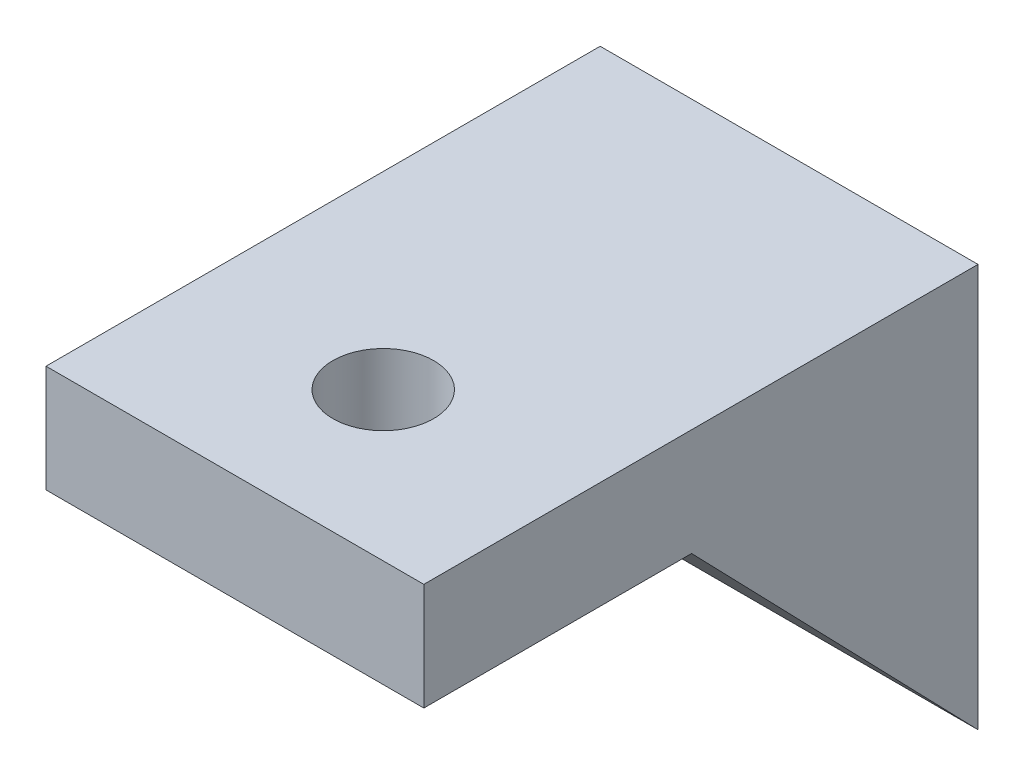
ISO-10303-21;
HEADER;
FILE_DESCRIPTION(('STEP AP214'),'2;1');
FILE_NAME('part.step','',(''),(''),'','','');
FILE_SCHEMA(('AUTOMOTIVE_DESIGN { 1 0 10303 214 1 1 1 1 }'));
ENDSEC;
DATA;
#1=APPLICATION_CONTEXT('core data for automotive mechanical design processes');
#2=APPLICATION_PROTOCOL_DEFINITION('international standard','automotive_design',2000,#1);
#3=PRODUCT_CONTEXT('',#1,'mechanical');
#4=PRODUCT('Part','Part','',(#3));
#5=PRODUCT_RELATED_PRODUCT_CATEGORY('part','',(#4));
#6=PRODUCT_DEFINITION_FORMATION('','',#4);
#7=PRODUCT_DEFINITION_CONTEXT('part definition',#1,'design');
#8=PRODUCT_DEFINITION('design','',#6,#7);
#9=PRODUCT_DEFINITION_SHAPE('','',#8);
#10=(LENGTH_UNIT() NAMED_UNIT(*) SI_UNIT(.MILLI.,.METRE.));
#11=(NAMED_UNIT(*) PLANE_ANGLE_UNIT() SI_UNIT($,.RADIAN.));
#12=(NAMED_UNIT(*) SI_UNIT($,.STERADIAN.) SOLID_ANGLE_UNIT());
#13=UNCERTAINTY_MEASURE_WITH_UNIT(LENGTH_MEASURE(1.E-05),#10,'distance_accuracy_value','');
#14=(GEOMETRIC_REPRESENTATION_CONTEXT(3) GLOBAL_UNCERTAINTY_ASSIGNED_CONTEXT((#13)) GLOBAL_UNIT_ASSIGNED_CONTEXT((#10,
#11,#12)) REPRESENTATION_CONTEXT('',''));
#15=CARTESIAN_POINT('',(0.,0.,0.));
#16=DIRECTION('',(0.,0.,1.));
#17=DIRECTION('',(1.,0.,0.));
#18=AXIS2_PLACEMENT_3D('',#15,#16,#17);
#19=CARTESIAN_POINT('',(-7.5,-8.,22.));
#20=DIRECTION('',(1.,0.,0.));
#21=DIRECTION('',(0.,0.,-1.));
#22=AXIS2_PLACEMENT_3D('',#19,#20,#21);
#23=PLANE('',#22);
#24=DIRECTION('',(0.,-0.718507049595563,-0.695519675984425));
#25=VECTOR('',#24,1.);
#26=CARTESIAN_POINT('',(-7.5,2.99418738719908,10.6424476329926));
#27=LINE('',#26,#25);
#28=CARTESIAN_POINT('',(-7.5,3.74573308859119,11.3699489470213));
#29=VERTEX_POINT('',#28);
#30=CARTESIAN_POINT('',(-7.5,-8.,0.));
#31=VERTEX_POINT('',#30);
#32=EDGE_CURVE('E129',#29,#31,#27,.T.);
#33=ORIENTED_EDGE('',*,*,#32,.F.);
#34=DIRECTION('',(0.,0.,-1.));
#35=VECTOR('',#34,1.);
#36=CARTESIAN_POINT('',(-7.5,3.74573308859119,22.));
#37=LINE('',#36,#35);
#38=CARTESIAN_POINT('',(-7.5,3.74573308859119,22.));
#39=VERTEX_POINT('',#38);
#40=EDGE_CURVE('E100',#39,#29,#37,.T.);
#41=ORIENTED_EDGE('',*,*,#40,.F.);
#42=DIRECTION('',(0.,-1.,0.));
#43=VECTOR('',#42,1.);
#44=CARTESIAN_POINT('',(-7.5,-8.,22.));
#45=LINE('',#44,#43);
#46=CARTESIAN_POINT('',(-7.5,8.,22.));
#47=VERTEX_POINT('',#46);
#48=EDGE_CURVE('E88',#47,#39,#45,.T.);
#49=ORIENTED_EDGE('',*,*,#48,.F.);
#50=DIRECTION('',(0.,0.,-1.));
#51=VECTOR('',#50,1.);
#52=CARTESIAN_POINT('',(-7.5,8.,22.));
#53=LINE('',#52,#51);
#54=CARTESIAN_POINT('',(-7.5,8.,0.));
#55=VERTEX_POINT('',#54);
#56=EDGE_CURVE('E84',#47,#55,#53,.T.);
#57=ORIENTED_EDGE('',*,*,#56,.T.);
#58=DIRECTION('',(0.,-1.,0.));
#59=VECTOR('',#58,1.);
#60=CARTESIAN_POINT('',(-7.5,-8.,0.));
#61=LINE('',#60,#59);
#62=EDGE_CURVE('E93',#55,#31,#61,.T.);
#63=ORIENTED_EDGE('',*,*,#62,.T.);
#64=EDGE_LOOP('',(#33,#41,#49,#57,#63));
#65=FACE_BOUND('',#64,.T.);
#66=ADVANCED_FACE('F44',(#65),#23,.F.);
#67=CARTESIAN_POINT('',(7.5,-8.,22.));
#68=DIRECTION('',(-1.,0.,0.));
#69=DIRECTION('',(0.,0.,1.));
#70=AXIS2_PLACEMENT_3D('',#67,#68,#69);
#71=PLANE('',#70);
#72=DIRECTION('',(0.,0.718507049595563,0.695519675984425));
#73=VECTOR('',#72,1.);
#74=CARTESIAN_POINT('',(7.5,2.99418738719908,10.6424476329926));
#75=LINE('',#74,#73);
#76=CARTESIAN_POINT('',(7.5,-8.,0.));
#77=VERTEX_POINT('',#76);
#78=CARTESIAN_POINT('',(7.5,3.74573308859119,11.3699489470213));
#79=VERTEX_POINT('',#78);
#80=EDGE_CURVE('E117',#77,#79,#75,.T.);
#81=ORIENTED_EDGE('',*,*,#80,.F.);
#82=DIRECTION('',(0.,1.,0.));
#83=VECTOR('',#82,1.);
#84=CARTESIAN_POINT('',(7.5,-8.,0.));
#85=LINE('',#84,#83);
#86=CARTESIAN_POINT('',(7.5,8.,0.));
#87=VERTEX_POINT('',#86);
#88=EDGE_CURVE('E76',#77,#87,#85,.T.);
#89=ORIENTED_EDGE('',*,*,#88,.T.);
#90=DIRECTION('',(0.,0.,-1.));
#91=VECTOR('',#90,1.);
#92=CARTESIAN_POINT('',(7.5,8.,22.));
#93=LINE('',#92,#91);
#94=CARTESIAN_POINT('',(7.5,8.,22.));
#95=VERTEX_POINT('',#94);
#96=EDGE_CURVE('E53',#95,#87,#93,.T.);
#97=ORIENTED_EDGE('',*,*,#96,.F.);
#98=DIRECTION('',(0.,1.,0.));
#99=VECTOR('',#98,1.);
#100=CARTESIAN_POINT('',(7.5,-8.,22.));
#101=LINE('',#100,#99);
#102=CARTESIAN_POINT('',(7.5,3.74573308859119,22.));
#103=VERTEX_POINT('',#102);
#104=EDGE_CURVE('E133',#103,#95,#101,.T.);
#105=ORIENTED_EDGE('',*,*,#104,.F.);
#106=DIRECTION('',(0.,0.,1.));
#107=VECTOR('',#106,1.);
#108=CARTESIAN_POINT('',(7.5,3.74573308859119,22.));
#109=LINE('',#108,#107);
#110=EDGE_CURVE('E104',#79,#103,#109,.T.);
#111=ORIENTED_EDGE('',*,*,#110,.F.);
#112=EDGE_LOOP('',(#81,#89,#97,#105,#111));
#113=FACE_BOUND('',#112,.T.);
#114=ADVANCED_FACE('F139',(#113),#71,.F.);
#115=CARTESIAN_POINT('',(0.,0.,22.));
#116=DIRECTION('',(0.,0.,1.));
#117=DIRECTION('',(1.,0.,0.));
#118=AXIS2_PLACEMENT_3D('',#115,#116,#117);
#119=PLANE('',#118);
#120=ORIENTED_EDGE('',*,*,#48,.T.);
#121=DIRECTION('',(1.,0.,0.));
#122=VECTOR('',#121,1.);
#123=CARTESIAN_POINT('',(0.,3.74573308859119,22.));
#124=LINE('',#123,#122);
#125=EDGE_CURVE('E11',#39,#103,#124,.T.);
#126=ORIENTED_EDGE('',*,*,#125,.T.);
#127=ORIENTED_EDGE('',*,*,#104,.T.);
#128=DIRECTION('',(-1.,0.,0.));
#129=VECTOR('',#128,1.);
#130=CARTESIAN_POINT('',(7.5,8.,22.));
#131=LINE('',#130,#129);
#132=EDGE_CURVE('E62',#95,#47,#131,.T.);
#133=ORIENTED_EDGE('',*,*,#132,.T.);
#134=EDGE_LOOP('',(#120,#126,#127,#133));
#135=FACE_BOUND('',#134,.T.);
#136=ADVANCED_FACE('F135',(#135),#119,.T.);
#137=CARTESIAN_POINT('',(7.5,8.,22.));
#138=DIRECTION('',(0.,-1.,0.));
#139=DIRECTION('',(1.,0.,0.));
#140=AXIS2_PLACEMENT_3D('',#137,#138,#139);
#141=PLANE('',#140);
#142=CARTESIAN_POINT('',(0.,8.,16.1107358945861));
#143=DIRECTION('',(0.,1.,0.));
#144=DIRECTION('',(-1.,0.,0.));
#145=AXIS2_PLACEMENT_3D('',#142,#143,#144);
#146=CIRCLE('',#145,2.);
#147=CARTESIAN_POINT('',(-2.,8.,16.1107358945861));
#148=VERTEX_POINT('',#147);
#149=EDGE_CURVE('E113',#148,#148,#146,.T.);
#150=ORIENTED_EDGE('',*,*,#149,.F.);
#151=EDGE_LOOP('',(#150));
#152=FACE_BOUND('',#151,.T.);
#153=DIRECTION('',(-1.,0.,0.));
#154=VECTOR('',#153,1.);
#155=CARTESIAN_POINT('',(7.5,8.,0.));
#156=LINE('',#155,#154);
#157=EDGE_CURVE('E81',#87,#55,#156,.T.);
#158=ORIENTED_EDGE('',*,*,#157,.T.);
#159=ORIENTED_EDGE('',*,*,#56,.F.);
#160=ORIENTED_EDGE('',*,*,#132,.F.);
#161=ORIENTED_EDGE('',*,*,#96,.T.);
#162=EDGE_LOOP('',(#158,#159,#160,#161));
#163=FACE_BOUND('',#162,.T.);
#164=ADVANCED_FACE('F83',(#152,#163),#141,.F.);
#165=CARTESIAN_POINT('',(0.,0.,0.));
#166=DIRECTION('',(0.,0.,1.));
#167=DIRECTION('',(1.,0.,0.));
#168=AXIS2_PLACEMENT_3D('',#165,#166,#167);
#169=PLANE('',#168);
#170=CARTESIAN_POINT('',(0.,0.,0.));
#171=DIRECTION('',(0.,0.,-1.));
#172=DIRECTION('',(-1.,0.,0.));
#173=AXIS2_PLACEMENT_3D('',#170,#171,#172);
#174=CIRCLE('',#173,2.);
#175=CARTESIAN_POINT('',(-2.,0.,0.));
#176=VERTEX_POINT('',#175);
#177=EDGE_CURVE('E124',#176,#176,#174,.T.);
#178=ORIENTED_EDGE('',*,*,#177,.F.);
#179=EDGE_LOOP('',(#178));
#180=FACE_BOUND('',#179,.T.);
#181=ORIENTED_EDGE('',*,*,#62,.F.);
#182=ORIENTED_EDGE('',*,*,#157,.F.);
#183=ORIENTED_EDGE('',*,*,#88,.F.);
#184=DIRECTION('',(1.,0.,0.));
#185=VECTOR('',#184,1.);
#186=CARTESIAN_POINT('',(7.5,-8.,0.));
#187=LINE('',#186,#185);
#188=EDGE_CURVE('E99',#31,#77,#187,.T.);
#189=ORIENTED_EDGE('',*,*,#188,.F.);
#190=EDGE_LOOP('',(#181,#182,#183,#189));
#191=FACE_BOUND('',#190,.T.);
#192=ADVANCED_FACE('F97',(#180,#191),#169,.F.);
#193=CARTESIAN_POINT('',(22.,3.74573308859119,22.));
#194=DIRECTION('',(0.,-1.,0.));
#195=DIRECTION('',(0.,0.,-1.));
#196=AXIS2_PLACEMENT_3D('',#193,#194,#195);
#197=PLANE('',#196);
#198=CARTESIAN_POINT('',(0.,3.74573308859119,16.1107358945861));
#199=DIRECTION('',(0.,-1.,0.));
#200=DIRECTION('',(0.,0.,-1.));
#201=AXIS2_PLACEMENT_3D('',#198,#199,#200);
#202=CIRCLE('',#201,2.);
#203=CARTESIAN_POINT('',(0.,3.74573308859119,14.1107358945861));
#204=VERTEX_POINT('',#203);
#205=EDGE_CURVE('E110',#204,#204,#202,.T.);
#206=ORIENTED_EDGE('',*,*,#205,.F.);
#207=EDGE_LOOP('',(#206));
#208=FACE_BOUND('',#207,.T.);
#209=ORIENTED_EDGE('',*,*,#40,.T.);
#210=DIRECTION('',(-1.,0.,0.));
#211=VECTOR('',#210,1.);
#212=CARTESIAN_POINT('',(22.,3.74573308859119,11.3699489470213));
#213=LINE('',#212,#211);
#214=EDGE_CURVE('E112',#79,#29,#213,.T.);
#215=ORIENTED_EDGE('',*,*,#214,.F.);
#216=ORIENTED_EDGE('',*,*,#110,.T.);
#217=ORIENTED_EDGE('',*,*,#125,.F.);
#218=EDGE_LOOP('',(#209,#215,#216,#217));
#219=FACE_BOUND('',#218,.T.);
#220=ADVANCED_FACE('F152',(#208,#219),#197,.T.);
#221=CARTESIAN_POINT('',(22.,3.74573308859119,11.3699489470213));
#222=DIRECTION('',(0.,-0.695519675984425,0.718507049595563));
#223=DIRECTION('',(0.,-0.718507049595563,-0.695519675984425));
#224=AXIS2_PLACEMENT_3D('',#221,#222,#223);
#225=PLANE('',#224);
#226=CARTESIAN_POINT('',(0.,0.,7.74405402286224));
#227=DIRECTION('',(0.,-0.695519675984425,0.718507049595563));
#228=DIRECTION('',(0.,-0.718507049595563,-0.695519675984425));
#229=AXIS2_PLACEMENT_3D('',#226,#227,#228);
#230=ELLIPSE('',#229,2.78354958538788,2.);
#231=CARTESIAN_POINT('',(0.,-2.,5.80804051714668));
#232=VERTEX_POINT('',#231);
#233=EDGE_CURVE('E47',#232,#232,#230,.T.);
#234=ORIENTED_EDGE('',*,*,#233,.F.);
#235=EDGE_LOOP('',(#234));
#236=FACE_BOUND('',#235,.T.);
#237=ORIENTED_EDGE('',*,*,#32,.T.);
#238=ORIENTED_EDGE('',*,*,#188,.T.);
#239=ORIENTED_EDGE('',*,*,#80,.T.);
#240=ORIENTED_EDGE('',*,*,#214,.T.);
#241=EDGE_LOOP('',(#237,#238,#239,#240));
#242=FACE_BOUND('',#241,.T.);
#243=ADVANCED_FACE('F155',(#236,#242),#225,.T.);
#244=CARTESIAN_POINT('',(0.,-14.,16.1107358945861));
#245=DIRECTION('',(0.,1.,0.));
#246=DIRECTION('',(-1.,0.,0.));
#247=AXIS2_PLACEMENT_3D('',#244,#245,#246);
#248=CYLINDRICAL_SURFACE('',#247,2.);
#249=ORIENTED_EDGE('',*,*,#205,.T.);
#250=EDGE_LOOP('',(#249));
#251=FACE_BOUND('',#250,.T.);
#252=ORIENTED_EDGE('',*,*,#149,.T.);
#253=EDGE_LOOP('',(#252));
#254=FACE_BOUND('',#253,.T.);
#255=ADVANCED_FACE('F158',(#251,#254),#248,.F.);
#256=CARTESIAN_POINT('',(0.,0.,10.));
#257=DIRECTION('',(0.,0.,-1.));
#258=DIRECTION('',(-1.,0.,0.));
#259=AXIS2_PLACEMENT_3D('',#256,#257,#258);
#260=CYLINDRICAL_SURFACE('',#259,2.);
#261=ORIENTED_EDGE('',*,*,#233,.T.);
#262=EDGE_LOOP('',(#261));
#263=FACE_BOUND('',#262,.T.);
#264=ORIENTED_EDGE('',*,*,#177,.T.);
#265=EDGE_LOOP('',(#264));
#266=FACE_BOUND('',#265,.T.);
#267=ADVANCED_FACE('F165',(#263,#266),#260,.F.);
#268=CLOSED_SHELL('',(#66,#114,#136,#164,#192,#220,#243,#255,#267));
#269=MANIFOLD_SOLID_BREP('B2',#268);
#270=ADVANCED_BREP_SHAPE_REPRESENTATION('',(#18,#269),#14);
#271=SHAPE_DEFINITION_REPRESENTATION(#9,#270);
ENDSEC;
END-ISO-10303-21;
